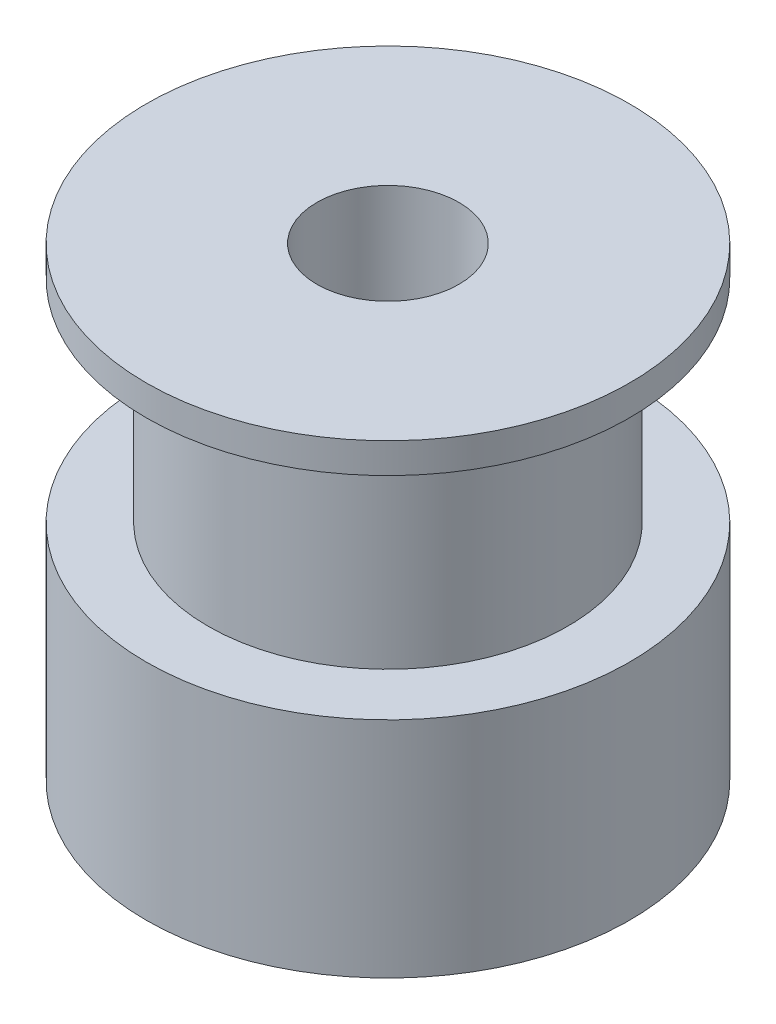
ISO-10303-21;
HEADER;
FILE_DESCRIPTION(('STEP AP214'),'2;1');
FILE_NAME('part.step','',(''),(''),'','','');
FILE_SCHEMA(('AUTOMOTIVE_DESIGN { 1 0 10303 214 1 1 1 1 }'));
ENDSEC;
DATA;
#1=APPLICATION_CONTEXT('core data for automotive mechanical design processes');
#2=APPLICATION_PROTOCOL_DEFINITION('international standard','automotive_design',2000,#1);
#3=PRODUCT_CONTEXT('',#1,'mechanical');
#4=PRODUCT('Part','Part','',(#3));
#5=PRODUCT_RELATED_PRODUCT_CATEGORY('part','',(#4));
#6=PRODUCT_DEFINITION_FORMATION('','',#4);
#7=PRODUCT_DEFINITION_CONTEXT('part definition',#1,'design');
#8=PRODUCT_DEFINITION('design','',#6,#7);
#9=PRODUCT_DEFINITION_SHAPE('','',#8);
#10=(LENGTH_UNIT() NAMED_UNIT(*) SI_UNIT(.MILLI.,.METRE.));
#11=(NAMED_UNIT(*) PLANE_ANGLE_UNIT() SI_UNIT($,.RADIAN.));
#12=(NAMED_UNIT(*) SI_UNIT($,.STERADIAN.) SOLID_ANGLE_UNIT());
#13=UNCERTAINTY_MEASURE_WITH_UNIT(LENGTH_MEASURE(1.E-05),#10,'distance_accuracy_value','');
#14=(GEOMETRIC_REPRESENTATION_CONTEXT(3) GLOBAL_UNCERTAINTY_ASSIGNED_CONTEXT((#13)) GLOBAL_UNIT_ASSIGNED_CONTEXT((#10,
#11,#12)) REPRESENTATION_CONTEXT('',''));
#15=CARTESIAN_POINT('',(0.,0.,0.));
#16=DIRECTION('',(0.,0.,1.));
#17=DIRECTION('',(1.,0.,0.));
#18=AXIS2_PLACEMENT_3D('',#15,#16,#17);
#19=CARTESIAN_POINT('',(0.,7.4,0.));
#20=DIRECTION('',(0.,-1.,0.));
#21=DIRECTION('',(0.,0.,-1.));
#22=AXIS2_PLACEMENT_3D('',#19,#20,#21);
#23=CYLINDRICAL_SURFACE('',#22,8.);
#24=CARTESIAN_POINT('',(0.,7.4,0.));
#25=DIRECTION('',(0.,1.,0.));
#26=DIRECTION('',(0.,0.,1.));
#27=AXIS2_PLACEMENT_3D('',#24,#25,#26);
#28=CIRCLE('',#27,8.);
#29=CARTESIAN_POINT('',(0.,7.4,8.));
#30=VERTEX_POINT('',#29);
#31=EDGE_CURVE('E42',#30,#30,#28,.T.);
#32=ORIENTED_EDGE('',*,*,#31,.F.);
#33=EDGE_LOOP('',(#32));
#34=FACE_BOUND('',#33,.T.);
#35=CARTESIAN_POINT('',(0.,0.,0.));
#36=DIRECTION('',(0.,1.,0.));
#37=DIRECTION('',(0.,0.,1.));
#38=AXIS2_PLACEMENT_3D('',#35,#36,#37);
#39=CIRCLE('',#38,8.);
#40=CARTESIAN_POINT('',(0.,0.,8.));
#41=VERTEX_POINT('',#40);
#42=EDGE_CURVE('E47',#41,#41,#39,.T.);
#43=ORIENTED_EDGE('',*,*,#42,.T.);
#44=EDGE_LOOP('',(#43));
#45=FACE_BOUND('',#44,.T.);
#46=ADVANCED_FACE('F35',(#34,#45),#23,.T.);
#47=CARTESIAN_POINT('',(0.,7.4,0.));
#48=DIRECTION('',(0.,1.,0.));
#49=DIRECTION('',(0.,0.,1.));
#50=AXIS2_PLACEMENT_3D('',#47,#48,#49);
#51=PLANE('',#50);
#52=CARTESIAN_POINT('',(0.,7.4,0.));
#53=DIRECTION('',(0.,1.,0.));
#54=DIRECTION('',(0.,0.,1.));
#55=AXIS2_PLACEMENT_3D('',#52,#53,#54);
#56=CIRCLE('',#55,5.95);
#57=CARTESIAN_POINT('',(0.,7.4,5.95));
#58=VERTEX_POINT('',#57);
#59=EDGE_CURVE('E10',#58,#58,#56,.T.);
#60=ORIENTED_EDGE('',*,*,#59,.F.);
#61=EDGE_LOOP('',(#60));
#62=FACE_BOUND('',#61,.T.);
#63=ORIENTED_EDGE('',*,*,#31,.T.);
#64=EDGE_LOOP('',(#63));
#65=FACE_BOUND('',#64,.T.);
#66=ADVANCED_FACE('F90',(#62,#65),#51,.T.);
#67=CARTESIAN_POINT('',(0.,0.,0.));
#68=DIRECTION('',(0.,1.,0.));
#69=DIRECTION('',(0.,0.,1.));
#70=AXIS2_PLACEMENT_3D('',#67,#68,#69);
#71=PLANE('',#70);
#72=CARTESIAN_POINT('',(0.,0.,0.));
#73=DIRECTION('',(0.,-1.,0.));
#74=DIRECTION('',(0.,0.,-1.));
#75=AXIS2_PLACEMENT_3D('',#72,#73,#74);
#76=CIRCLE('',#75,2.35);
#77=CARTESIAN_POINT('',(0.,0.,-2.35));
#78=VERTEX_POINT('',#77);
#79=EDGE_CURVE('E66',#78,#78,#76,.T.);
#80=ORIENTED_EDGE('',*,*,#79,.F.);
#81=EDGE_LOOP('',(#80));
#82=FACE_BOUND('',#81,.T.);
#83=ORIENTED_EDGE('',*,*,#42,.F.);
#84=EDGE_LOOP('',(#83));
#85=FACE_BOUND('',#84,.T.);
#86=ADVANCED_FACE('F95',(#82,#85),#71,.F.);
#87=CARTESIAN_POINT('',(0.,14.4,0.));
#88=DIRECTION('',(0.,-1.,0.));
#89=DIRECTION('',(0.,0.,-1.));
#90=AXIS2_PLACEMENT_3D('',#87,#88,#89);
#91=CYLINDRICAL_SURFACE('',#90,5.95);
#92=CARTESIAN_POINT('',(0.,14.4,0.));
#93=DIRECTION('',(0.,1.,0.));
#94=DIRECTION('',(0.,0.,1.));
#95=AXIS2_PLACEMENT_3D('',#92,#93,#94);
#96=CIRCLE('',#95,5.95);
#97=CARTESIAN_POINT('',(0.,14.4,5.95));
#98=VERTEX_POINT('',#97);
#99=EDGE_CURVE('E50',#98,#98,#96,.T.);
#100=ORIENTED_EDGE('',*,*,#99,.F.);
#101=EDGE_LOOP('',(#100));
#102=FACE_BOUND('',#101,.T.);
#103=ORIENTED_EDGE('',*,*,#59,.T.);
#104=EDGE_LOOP('',(#103));
#105=FACE_BOUND('',#104,.T.);
#106=ADVANCED_FACE('F85',(#102,#105),#91,.T.);
#107=CARTESIAN_POINT('',(0.,15.4,0.));
#108=DIRECTION('',(0.,-1.,0.));
#109=DIRECTION('',(0.,0.,-1.));
#110=AXIS2_PLACEMENT_3D('',#107,#108,#109);
#111=CYLINDRICAL_SURFACE('',#110,8.);
#112=CARTESIAN_POINT('',(0.,15.4,0.));
#113=DIRECTION('',(0.,1.,0.));
#114=DIRECTION('',(0.,0.,1.));
#115=AXIS2_PLACEMENT_3D('',#112,#113,#114);
#116=CIRCLE('',#115,8.);
#117=CARTESIAN_POINT('',(0.,15.4,8.));
#118=VERTEX_POINT('',#117);
#119=EDGE_CURVE('E56',#118,#118,#116,.T.);
#120=ORIENTED_EDGE('',*,*,#119,.F.);
#121=EDGE_LOOP('',(#120));
#122=FACE_BOUND('',#121,.T.);
#123=CARTESIAN_POINT('',(0.,14.4,0.));
#124=DIRECTION('',(0.,1.,0.));
#125=DIRECTION('',(0.,0.,1.));
#126=AXIS2_PLACEMENT_3D('',#123,#124,#125);
#127=CIRCLE('',#126,8.);
#128=CARTESIAN_POINT('',(0.,14.4,8.));
#129=VERTEX_POINT('',#128);
#130=EDGE_CURVE('E60',#129,#129,#127,.T.);
#131=ORIENTED_EDGE('',*,*,#130,.T.);
#132=EDGE_LOOP('',(#131));
#133=FACE_BOUND('',#132,.T.);
#134=ADVANCED_FACE('F78',(#122,#133),#111,.T.);
#135=CARTESIAN_POINT('',(0.,15.4,0.));
#136=DIRECTION('',(0.,1.,0.));
#137=DIRECTION('',(0.,0.,1.));
#138=AXIS2_PLACEMENT_3D('',#135,#136,#137);
#139=PLANE('',#138);
#140=CARTESIAN_POINT('',(0.,15.4,0.));
#141=DIRECTION('',(0.,1.,0.));
#142=DIRECTION('',(0.,0.,1.));
#143=AXIS2_PLACEMENT_3D('',#140,#141,#142);
#144=CIRCLE('',#143,2.35);
#145=CARTESIAN_POINT('',(0.,15.4,2.35));
#146=VERTEX_POINT('',#145);
#147=EDGE_CURVE('E38',#146,#146,#144,.T.);
#148=ORIENTED_EDGE('',*,*,#147,.F.);
#149=EDGE_LOOP('',(#148));
#150=FACE_BOUND('',#149,.T.);
#151=ORIENTED_EDGE('',*,*,#119,.T.);
#152=EDGE_LOOP('',(#151));
#153=FACE_BOUND('',#152,.T.);
#154=ADVANCED_FACE('F75',(#150,#153),#139,.T.);
#155=CARTESIAN_POINT('',(0.,14.4,0.));
#156=DIRECTION('',(0.,1.,0.));
#157=DIRECTION('',(0.,0.,1.));
#158=AXIS2_PLACEMENT_3D('',#155,#156,#157);
#159=PLANE('',#158);
#160=ORIENTED_EDGE('',*,*,#99,.T.);
#161=EDGE_LOOP('',(#160));
#162=FACE_BOUND('',#161,.T.);
#163=ORIENTED_EDGE('',*,*,#130,.F.);
#164=EDGE_LOOP('',(#163));
#165=FACE_BOUND('',#164,.T.);
#166=ADVANCED_FACE('F77',(#162,#165),#159,.F.);
#167=CARTESIAN_POINT('',(0.,21.,0.));
#168=DIRECTION('',(0.,-1.,0.));
#169=DIRECTION('',(0.,0.,-1.));
#170=AXIS2_PLACEMENT_3D('',#167,#168,#169);
#171=CYLINDRICAL_SURFACE('',#170,2.35);
#172=ORIENTED_EDGE('',*,*,#147,.T.);
#173=EDGE_LOOP('',(#172));
#174=FACE_BOUND('',#173,.T.);
#175=ORIENTED_EDGE('',*,*,#79,.T.);
#176=EDGE_LOOP('',(#175));
#177=FACE_BOUND('',#176,.T.);
#178=ADVANCED_FACE('F73',(#174,#177),#171,.F.);
#179=CLOSED_SHELL('',(#46,#66,#86,#106,#134,#154,#166,#178));
#180=MANIFOLD_SOLID_BREP('B2',#179);
#181=ADVANCED_BREP_SHAPE_REPRESENTATION('',(#18,#180),#14);
#182=SHAPE_DEFINITION_REPRESENTATION(#9,#181);
ENDSEC;
END-ISO-10303-21;
